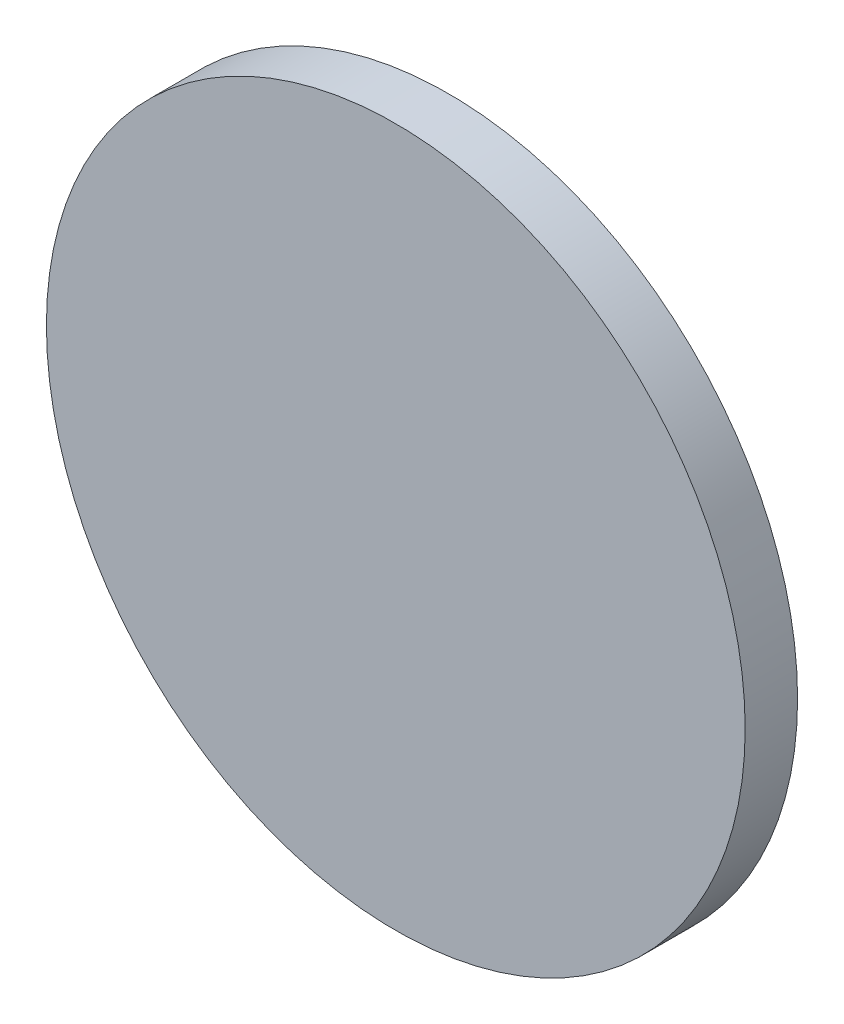
ISO-10303-21;
HEADER;
FILE_DESCRIPTION(('STEP AP214'),'2;1');
FILE_NAME('part.step','',(''),(''),'','','');
FILE_SCHEMA(('AUTOMOTIVE_DESIGN { 1 0 10303 214 1 1 1 1 }'));
ENDSEC;
DATA;
#1=APPLICATION_CONTEXT('core data for automotive mechanical design processes');
#2=APPLICATION_PROTOCOL_DEFINITION('international standard','automotive_design',2000,#1);
#3=PRODUCT_CONTEXT('',#1,'mechanical');
#4=PRODUCT('Part','Part','',(#3));
#5=PRODUCT_RELATED_PRODUCT_CATEGORY('part','',(#4));
#6=PRODUCT_DEFINITION_FORMATION('','',#4);
#7=PRODUCT_DEFINITION_CONTEXT('part definition',#1,'design');
#8=PRODUCT_DEFINITION('design','',#6,#7);
#9=PRODUCT_DEFINITION_SHAPE('','',#8);
#10=(LENGTH_UNIT() NAMED_UNIT(*) SI_UNIT(.MILLI.,.METRE.));
#11=(NAMED_UNIT(*) PLANE_ANGLE_UNIT() SI_UNIT($,.RADIAN.));
#12=(NAMED_UNIT(*) SI_UNIT($,.STERADIAN.) SOLID_ANGLE_UNIT());
#13=UNCERTAINTY_MEASURE_WITH_UNIT(LENGTH_MEASURE(1.E-05),#10,'distance_accuracy_value','');
#14=(GEOMETRIC_REPRESENTATION_CONTEXT(3) GLOBAL_UNCERTAINTY_ASSIGNED_CONTEXT((#13)) GLOBAL_UNIT_ASSIGNED_CONTEXT((#10,
#11,#12)) REPRESENTATION_CONTEXT('',''));
#15=CARTESIAN_POINT('',(0.,0.,0.));
#16=DIRECTION('',(0.,0.,1.));
#17=DIRECTION('',(1.,0.,0.));
#18=AXIS2_PLACEMENT_3D('',#15,#16,#17);
#19=CARTESIAN_POINT('',(12.53916,12.10491,0.));
#20=DIRECTION('',(0.,0.,-1.));
#21=DIRECTION('',(-1.,0.,0.));
#22=AXIS2_PLACEMENT_3D('',#19,#20,#21);
#23=PLANE('',#22);
#24=CARTESIAN_POINT('',(12.53916,12.10491,0.));
#25=DIRECTION('',(0.,0.,1.));
#26=DIRECTION('',(1.,0.,0.));
#27=AXIS2_PLACEMENT_3D('',#24,#25,#26);
#28=CIRCLE('',#27,0.2286);
#29=CARTESIAN_POINT('',(12.76776,12.10491,0.));
#30=VERTEX_POINT('',#29);
#31=EDGE_CURVE('E18',#30,#30,#28,.T.);
#32=ORIENTED_EDGE('',*,*,#31,.F.);
#33=EDGE_LOOP('',(#32));
#34=FACE_BOUND('',#33,.T.);
#35=ADVANCED_FACE('F15',(#34),#23,.T.);
#36=CARTESIAN_POINT('',(12.53916,12.10491,0.));
#37=DIRECTION('',(0.,0.,1.));
#38=DIRECTION('',(1.,0.,0.));
#39=AXIS2_PLACEMENT_3D('',#36,#37,#38);
#40=CYLINDRICAL_SURFACE('',#39,0.2286);
#41=CARTESIAN_POINT('',(12.53916,12.10491,0.03429));
#42=DIRECTION('',(0.,0.,1.));
#43=DIRECTION('',(1.,0.,0.));
#44=AXIS2_PLACEMENT_3D('',#41,#42,#43);
#45=CIRCLE('',#44,0.2286);
#46=CARTESIAN_POINT('',(12.76776,12.10491,0.03429));
#47=VERTEX_POINT('',#46);
#48=EDGE_CURVE('E10',#47,#47,#45,.T.);
#49=ORIENTED_EDGE('',*,*,#48,.F.);
#50=EDGE_LOOP('',(#49));
#51=FACE_BOUND('',#50,.T.);
#52=ORIENTED_EDGE('',*,*,#31,.T.);
#53=EDGE_LOOP('',(#52));
#54=FACE_BOUND('',#53,.T.);
#55=ADVANCED_FACE('F27',(#51,#54),#40,.T.);
#56=CARTESIAN_POINT('',(12.53916,12.10491,0.03429));
#57=DIRECTION('',(0.,0.,1.));
#58=DIRECTION('',(1.,0.,0.));
#59=AXIS2_PLACEMENT_3D('',#56,#57,#58);
#60=PLANE('',#59);
#61=ORIENTED_EDGE('',*,*,#48,.T.);
#62=EDGE_LOOP('',(#61));
#63=FACE_BOUND('',#62,.T.);
#64=ADVANCED_FACE('F34',(#63),#60,.T.);
#65=CLOSED_SHELL('',(#35,#55,#64));
#66=MANIFOLD_SOLID_BREP('B1',#65);
#67=ADVANCED_BREP_SHAPE_REPRESENTATION('',(#18,#66),#14);
#68=SHAPE_DEFINITION_REPRESENTATION(#9,#67);
ENDSEC;
END-ISO-10303-21;
